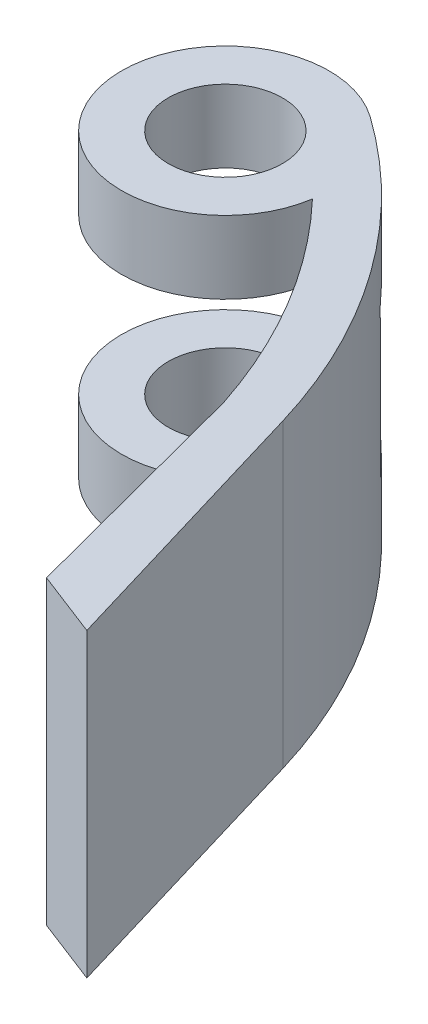
ISO-10303-21;
HEADER;
FILE_DESCRIPTION(('STEP AP214'),'2;1');
FILE_NAME('part.step','',(''),(''),'','','');
FILE_SCHEMA(('AUTOMOTIVE_DESIGN { 1 0 10303 214 1 1 1 1 }'));
ENDSEC;
DATA;
#1=APPLICATION_CONTEXT('core data for automotive mechanical design processes');
#2=APPLICATION_PROTOCOL_DEFINITION('international standard','automotive_design',2000,#1);
#3=PRODUCT_CONTEXT('',#1,'mechanical');
#4=PRODUCT('Part','Part','',(#3));
#5=PRODUCT_RELATED_PRODUCT_CATEGORY('part','',(#4));
#6=PRODUCT_DEFINITION_FORMATION('','',#4);
#7=PRODUCT_DEFINITION_CONTEXT('part definition',#1,'design');
#8=PRODUCT_DEFINITION('design','',#6,#7);
#9=PRODUCT_DEFINITION_SHAPE('','',#8);
#10=(LENGTH_UNIT() NAMED_UNIT(*) SI_UNIT(.MILLI.,.METRE.));
#11=(NAMED_UNIT(*) PLANE_ANGLE_UNIT() SI_UNIT($,.RADIAN.));
#12=(NAMED_UNIT(*) SI_UNIT($,.STERADIAN.) SOLID_ANGLE_UNIT());
#13=UNCERTAINTY_MEASURE_WITH_UNIT(LENGTH_MEASURE(1.E-05),#10,'distance_accuracy_value','');
#14=(GEOMETRIC_REPRESENTATION_CONTEXT(3) GLOBAL_UNCERTAINTY_ASSIGNED_CONTEXT((#13)) GLOBAL_UNIT_ASSIGNED_CONTEXT((#10,
#11,#12)) REPRESENTATION_CONTEXT('',''));
#15=CARTESIAN_POINT('',(0.,0.,0.));
#16=DIRECTION('',(0.,0.,1.));
#17=DIRECTION('',(1.,0.,0.));
#18=AXIS2_PLACEMENT_3D('',#15,#16,#17);
#19=CARTESIAN_POINT('',(-7.61734022617568,29.,-22.6247450499297));
#20=DIRECTION('',(0.,-1.,0.));
#21=DIRECTION('',(0.,0.,-1.));
#22=AXIS2_PLACEMENT_3D('',#19,#20,#21);
#23=CYLINDRICAL_SURFACE('',#22,55.9999999999987);
#24=CARTESIAN_POINT('',(-7.61734022617568,22.,-22.6247450499297));
#25=DIRECTION('',(0.,1.,0.));
#26=DIRECTION('',(0.,0.,1.));
#27=AXIS2_PLACEMENT_3D('',#24,#25,#26);
#28=CIRCLE('',#27,55.9999999999987);
#29=CARTESIAN_POINT('',(34.5830395151226,22.,-59.4368076067884));
#30=VERTEX_POINT('',#29);
#31=CARTESIAN_POINT('',(32.9081332083161,22.,-61.2729791998901));
#32=VERTEX_POINT('',#31);
#33=EDGE_CURVE('E172',#30,#32,#28,.T.);
#34=ORIENTED_EDGE('',*,*,#33,.F.);
#35=DIRECTION('',(0.,-1.,0.));
#36=VECTOR('',#35,1.);
#37=CARTESIAN_POINT('',(34.5830395151226,29.,-59.4368076067884));
#38=LINE('',#37,#36);
#39=CARTESIAN_POINT('',(34.5830395151226,21.,-59.4368076067884));
#40=VERTEX_POINT('',#39);
#41=EDGE_CURVE('E159',#30,#40,#38,.T.);
#42=ORIENTED_EDGE('',*,*,#41,.T.);
#43=DIRECTION('',(0.,-1.,0.));
#44=VECTOR('',#43,1.);
#45=CARTESIAN_POINT('',(34.5830395151226,29.,-59.4368076067884));
#46=LINE('',#45,#44);
#47=CARTESIAN_POINT('',(34.5830395151226,7.,-59.4368076067884));
#48=VERTEX_POINT('',#47);
#49=EDGE_CURVE('E198',#48,#40,#46,.F.);
#50=ORIENTED_EDGE('',*,*,#49,.F.);
#51=CARTESIAN_POINT('',(-7.61734022617568,7.,-22.6247450499297));
#52=DIRECTION('',(0.,-1.,0.));
#53=DIRECTION('',(0.,0.,-1.));
#54=AXIS2_PLACEMENT_3D('',#51,#52,#53);
#55=CIRCLE('',#54,55.9999999999987);
#56=CARTESIAN_POINT('',(32.9081332083161,7.,-61.2729791998901));
#57=VERTEX_POINT('',#56);
#58=EDGE_CURVE('E193',#57,#48,#55,.T.);
#59=ORIENTED_EDGE('',*,*,#58,.F.);
#60=DIRECTION('',(0.,-1.,0.));
#61=VECTOR('',#60,1.);
#62=CARTESIAN_POINT('',(32.9081332083161,29.,-61.2729791998901));
#63=LINE('',#62,#61);
#64=CARTESIAN_POINT('',(32.9081332083161,0.,-61.2729791998901));
#65=VERTEX_POINT('',#64);
#66=EDGE_CURVE('E250',#57,#65,#63,.T.);
#67=ORIENTED_EDGE('',*,*,#66,.T.);
#68=CARTESIAN_POINT('',(-7.61734022617568,0.,-22.6247450499297));
#69=DIRECTION('',(0.,1.,0.));
#70=DIRECTION('',(0.,0.,1.));
#71=AXIS2_PLACEMENT_3D('',#68,#69,#70);
#72=CIRCLE('',#71,55.9999999999987);
#73=CARTESIAN_POINT('',(45.618872447791,0.,-40.0001777102133));
#74=VERTEX_POINT('',#73);
#75=EDGE_CURVE('E226',#74,#65,#72,.T.);
#76=ORIENTED_EDGE('',*,*,#75,.F.);
#77=DIRECTION('',(0.,-1.,0.));
#78=VECTOR('',#77,1.);
#79=CARTESIAN_POINT('',(45.618872447791,29.,-40.0001777102133));
#80=LINE('',#79,#78);
#81=CARTESIAN_POINT('',(45.618872447791,29.,-40.0001777102133));
#82=VERTEX_POINT('',#81);
#83=EDGE_CURVE('E248',#82,#74,#80,.T.);
#84=ORIENTED_EDGE('',*,*,#83,.F.);
#85=CARTESIAN_POINT('',(-7.61734022617568,29.,-22.6247450499297));
#86=DIRECTION('',(0.,1.,0.));
#87=DIRECTION('',(0.,0.,1.));
#88=AXIS2_PLACEMENT_3D('',#85,#86,#87);
#89=CIRCLE('',#88,55.9999999999987);
#90=CARTESIAN_POINT('',(32.9081332083161,29.,-61.2729791998901));
#91=VERTEX_POINT('',#90);
#92=EDGE_CURVE('E208',#82,#91,#89,.T.);
#93=ORIENTED_EDGE('',*,*,#92,.T.);
#94=EDGE_CURVE('E251',#91,#32,#63,.T.);
#95=ORIENTED_EDGE('',*,*,#94,.T.);
#96=EDGE_LOOP('',(#34,#42,#50,#59,#67,#76,#84,#93,#95));
#97=FACE_BOUND('',#96,.T.);
#98=ADVANCED_FACE('F35',(#97),#23,.F.);
#99=CARTESIAN_POINT('',(-3.64937591935032,29.,-25.2895708429214));
#100=DIRECTION('',(0.,-1.,0.));
#101=DIRECTION('',(0.,0.,-1.));
#102=AXIS2_PLACEMENT_3D('',#99,#100,#101);
#103=CYLINDRICAL_SURFACE('',#102,56.);
#104=CARTESIAN_POINT('',(-3.64937591935032,21.,-25.2895708429214));
#105=DIRECTION('',(0.,1.,0.));
#106=DIRECTION('',(0.,0.,1.));
#107=AXIS2_PLACEMENT_3D('',#104,#105,#106);
#108=CIRCLE('',#107,56.);
#109=CARTESIAN_POINT('',(38.1282274530216,21.,-62.5807474998838));
#110=VERTEX_POINT('',#109);
#111=CARTESIAN_POINT('',(38.0522506094171,21.,-62.6656908242036));
#112=VERTEX_POINT('',#111);
#113=EDGE_CURVE('E165',#110,#112,#108,.T.);
#114=ORIENTED_EDGE('',*,*,#113,.F.);
#115=DIRECTION('',(0.,-1.,0.));
#116=VECTOR('',#115,1.);
#117=CARTESIAN_POINT('',(38.1282274530216,29.,-62.5807474998838));
#118=LINE('',#117,#116);
#119=CARTESIAN_POINT('',(38.1282274530216,22.,-62.5807474998838));
#120=VERTEX_POINT('',#119);
#121=EDGE_CURVE('E156',#120,#110,#118,.T.);
#122=ORIENTED_EDGE('',*,*,#121,.F.);
#123=CARTESIAN_POINT('',(-3.64937591935032,22.,-25.2895708429214));
#124=DIRECTION('',(0.,1.,0.));
#125=DIRECTION('',(0.,0.,1.));
#126=AXIS2_PLACEMENT_3D('',#123,#124,#125);
#127=CIRCLE('',#126,56.);
#128=CARTESIAN_POINT('',(28.818508763389,22.,-70.9167169757703));
#129=VERTEX_POINT('',#128);
#130=EDGE_CURVE('E11',#120,#129,#127,.T.);
#131=ORIENTED_EDGE('',*,*,#130,.T.);
#132=DIRECTION('',(0.,-1.,0.));
#133=VECTOR('',#132,1.);
#134=CARTESIAN_POINT('',(28.818508763389,29.,-70.9167169757702));
#135=LINE('',#134,#133);
#136=CARTESIAN_POINT('',(28.818508763389,29.,-70.9167169757702));
#137=VERTEX_POINT('',#136);
#138=EDGE_CURVE('E239',#137,#129,#135,.T.);
#139=ORIENTED_EDGE('',*,*,#138,.F.);
#140=CARTESIAN_POINT('',(-3.64937591935032,29.,-25.2895708429214));
#141=DIRECTION('',(0.,1.,0.));
#142=DIRECTION('',(0.,0.,1.));
#143=AXIS2_PLACEMENT_3D('',#140,#141,#142);
#144=CIRCLE('',#143,56.);
#145=CARTESIAN_POINT('',(50.0097940460506,29.,-41.3112273934852));
#146=VERTEX_POINT('',#145);
#147=EDGE_CURVE('E218',#146,#137,#144,.T.);
#148=ORIENTED_EDGE('',*,*,#147,.F.);
#149=DIRECTION('',(0.,-1.,0.));
#150=VECTOR('',#149,1.);
#151=CARTESIAN_POINT('',(50.0097940460506,29.,-41.3112273934852));
#152=LINE('',#151,#150);
#153=CARTESIAN_POINT('',(50.0097940460506,0.,-41.3112273934852));
#154=VERTEX_POINT('',#153);
#155=EDGE_CURVE('E241',#146,#154,#152,.T.);
#156=ORIENTED_EDGE('',*,*,#155,.T.);
#157=CARTESIAN_POINT('',(-3.64937591935032,0.,-25.2895708429214));
#158=DIRECTION('',(0.,1.,0.));
#159=DIRECTION('',(0.,0.,1.));
#160=AXIS2_PLACEMENT_3D('',#157,#158,#159);
#161=CIRCLE('',#160,56.);
#162=CARTESIAN_POINT('',(28.818508763389,0.,-70.9167169757702));
#163=VERTEX_POINT('',#162);
#164=EDGE_CURVE('E206',#154,#163,#161,.T.);
#165=ORIENTED_EDGE('',*,*,#164,.T.);
#166=CARTESIAN_POINT('',(28.818508763389,7.,-70.9167169757703));
#167=VERTEX_POINT('',#166);
#168=EDGE_CURVE('E220',#167,#163,#135,.T.);
#169=ORIENTED_EDGE('',*,*,#168,.F.);
#170=CARTESIAN_POINT('',(-3.64937591935032,7.,-25.2895708429214));
#171=DIRECTION('',(0.,-1.,0.));
#172=DIRECTION('',(0.,0.,-1.));
#173=AXIS2_PLACEMENT_3D('',#170,#171,#172);
#174=CIRCLE('',#173,56.);
#175=CARTESIAN_POINT('',(38.0522506094171,7.,-62.6656908242036));
#176=VERTEX_POINT('',#175);
#177=EDGE_CURVE('E254',#167,#176,#174,.T.);
#178=ORIENTED_EDGE('',*,*,#177,.T.);
#179=DIRECTION('',(0.,-1.,0.));
#180=VECTOR('',#179,1.);
#181=CARTESIAN_POINT('',(38.0522506094171,29.,-62.6656908242036));
#182=LINE('',#181,#180);
#183=EDGE_CURVE('E257',#176,#112,#182,.F.);
#184=ORIENTED_EDGE('',*,*,#183,.T.);
#185=EDGE_LOOP('',(#114,#122,#131,#139,#148,#156,#165,#169,#178,#184));
#186=FACE_BOUND('',#185,.T.);
#187=ADVANCED_FACE('F163',(#186),#103,.T.);
#188=CARTESIAN_POINT('',(23.0206722128998,29.,-62.7690123091901));
#189=DIRECTION('',(0.,-1.,0.));
#190=DIRECTION('',(0.,0.,-1.));
#191=AXIS2_PLACEMENT_3D('',#188,#189,#190);
#192=CYLINDRICAL_SURFACE('',#191,10.);
#193=ORIENTED_EDGE('',*,*,#138,.T.);
#194=CARTESIAN_POINT('',(23.0206722128998,22.,-62.7690123091901));
#195=DIRECTION('',(0.,1.,0.));
#196=DIRECTION('',(0.,0.,1.));
#197=AXIS2_PLACEMENT_3D('',#194,#195,#196);
#198=CIRCLE('',#197,10.);
#199=EDGE_CURVE('E148',#129,#32,#198,.T.);
#200=ORIENTED_EDGE('',*,*,#199,.T.);
#201=ORIENTED_EDGE('',*,*,#94,.F.);
#202=CARTESIAN_POINT('',(23.0206722128998,29.,-62.7690123091901));
#203=DIRECTION('',(0.,1.,0.));
#204=DIRECTION('',(0.,0.,1.));
#205=AXIS2_PLACEMENT_3D('',#202,#203,#204);
#206=CIRCLE('',#205,10.);
#207=EDGE_CURVE('E205',#137,#91,#206,.T.);
#208=ORIENTED_EDGE('',*,*,#207,.F.);
#209=EDGE_LOOP('',(#193,#200,#201,#208));
#210=FACE_BOUND('',#209,.T.);
#211=ADVANCED_FACE('F323',(#210),#192,.T.);
#212=CARTESIAN_POINT('',(23.0206722128998,29.,-62.7690123091901));
#213=DIRECTION('',(0.,-1.,0.));
#214=DIRECTION('',(0.,0.,-1.));
#215=AXIS2_PLACEMENT_3D('',#212,#213,#214);
#216=CYLINDRICAL_SURFACE('',#215,5.50000000000001);
#217=CARTESIAN_POINT('',(23.0206722128998,22.,-62.7690123091901));
#218=DIRECTION('',(0.,1.,0.));
#219=DIRECTION('',(0.,0.,1.));
#220=AXIS2_PLACEMENT_3D('',#217,#218,#219);
#221=CIRCLE('',#220,5.50000000000001);
#222=CARTESIAN_POINT('',(23.0206722128998,22.,-57.2690123091901));
#223=VERTEX_POINT('',#222);
#224=EDGE_CURVE('E174',#223,#223,#221,.T.);
#225=ORIENTED_EDGE('',*,*,#224,.F.);
#226=EDGE_LOOP('',(#225));
#227=FACE_BOUND('',#226,.T.);
#228=CARTESIAN_POINT('',(23.0206722128998,29.,-62.7690123091901));
#229=DIRECTION('',(0.,1.,0.));
#230=DIRECTION('',(0.,0.,1.));
#231=AXIS2_PLACEMENT_3D('',#228,#229,#230);
#232=CIRCLE('',#231,5.50000000000001);
#233=CARTESIAN_POINT('',(23.0206722128998,29.,-57.2690123091901));
#234=VERTEX_POINT('',#233);
#235=EDGE_CURVE('E202',#234,#234,#232,.T.);
#236=ORIENTED_EDGE('',*,*,#235,.T.);
#237=EDGE_LOOP('',(#236));
#238=FACE_BOUND('',#237,.T.);
#239=ADVANCED_FACE('F325',(#227,#238),#216,.F.);
#240=ORIENTED_EDGE('',*,*,#66,.F.);
#241=CARTESIAN_POINT('',(23.0206722128998,7.,-62.7690123091901));
#242=DIRECTION('',(0.,-1.,0.));
#243=DIRECTION('',(0.,0.,-1.));
#244=AXIS2_PLACEMENT_3D('',#241,#242,#243);
#245=CIRCLE('',#244,10.);
#246=EDGE_CURVE('E188',#57,#167,#245,.T.);
#247=ORIENTED_EDGE('',*,*,#246,.T.);
#248=ORIENTED_EDGE('',*,*,#168,.T.);
#249=CARTESIAN_POINT('',(23.0206722128998,0.,-62.7690123091901));
#250=DIRECTION('',(0.,1.,0.));
#251=DIRECTION('',(0.,0.,1.));
#252=AXIS2_PLACEMENT_3D('',#249,#250,#251);
#253=CIRCLE('',#252,10.);
#254=EDGE_CURVE('E223',#163,#65,#253,.T.);
#255=ORIENTED_EDGE('',*,*,#254,.T.);
#256=EDGE_LOOP('',(#240,#247,#248,#255));
#257=FACE_BOUND('',#256,.T.);
#258=ADVANCED_FACE('F293',(#257),#192,.T.);
#259=CARTESIAN_POINT('',(52.5085936316344,29.,-13.816725342061));
#260=DIRECTION('',(0.967080545762288,0.,-0.254470465885758));
#261=DIRECTION('',(-0.254470465885758,0.,-0.967080545762288));
#262=AXIS2_PLACEMENT_3D('',#259,#260,#261);
#263=PLANE('',#262);
#264=DIRECTION('',(-0.254470465885758,0.,-0.967080545762288));
#265=VECTOR('',#264,1.);
#266=CARTESIAN_POINT('',(52.5085936316344,15.5,-13.816725342061));
#267=LINE('',#266,#265);
#268=CARTESIAN_POINT('',(49.829088917422,15.5,-23.9998201557295));
#269=VERTEX_POINT('',#268);
#270=CARTESIAN_POINT('',(49.3201479856505,15.5,-25.9339812472541));
#271=VERTEX_POINT('',#270);
#272=EDGE_CURVE('E268',#269,#271,#267,.T.);
#273=ORIENTED_EDGE('',*,*,#272,.F.);
#274=DIRECTION('',(0.,-1.,0.));
#275=VECTOR('',#274,1.);
#276=CARTESIAN_POINT('',(49.829088917422,15.5,-23.9998201557295));
#277=LINE('',#276,#275);
#278=CARTESIAN_POINT('',(49.829088917422,13.5,-23.9998201557295));
#279=VERTEX_POINT('',#278);
#280=EDGE_CURVE('E43',#269,#279,#277,.T.);
#281=ORIENTED_EDGE('',*,*,#280,.T.);
#282=DIRECTION('',(-0.254470465885758,0.,-0.967080545762288));
#283=VECTOR('',#282,1.);
#284=CARTESIAN_POINT('',(52.5085936316344,13.5,-13.816725342061));
#285=LINE('',#284,#283);
#286=CARTESIAN_POINT('',(49.3201479856505,13.5,-25.9339812472541));
#287=VERTEX_POINT('',#286);
#288=EDGE_CURVE('E263',#279,#287,#285,.T.);
#289=ORIENTED_EDGE('',*,*,#288,.T.);
#290=DIRECTION('',(0.,-1.,0.));
#291=VECTOR('',#290,1.);
#292=CARTESIAN_POINT('',(49.3201479856505,15.5,-25.9339812472541));
#293=LINE('',#292,#291);
#294=EDGE_CURVE('E271',#271,#287,#293,.T.);
#295=ORIENTED_EDGE('',*,*,#294,.F.);
#296=EDGE_LOOP('',(#273,#281,#289,#295));
#297=FACE_BOUND('',#296,.T.);
#298=CARTESIAN_POINT('',(48.3022661221075,13.5,-29.8023034303033));
#299=VERTEX_POINT('',#298);
#300=CARTESIAN_POINT('',(47.793325190336,13.5,-31.7364645218278));
#301=VERTEX_POINT('',#300);
#302=EDGE_CURVE('E259',#299,#301,#285,.T.);
#303=ORIENTED_EDGE('',*,*,#302,.T.);
#304=DIRECTION('',(0.,-1.,0.));
#305=VECTOR('',#304,1.);
#306=CARTESIAN_POINT('',(47.793325190336,15.5,-31.7364645218278));
#307=LINE('',#306,#305);
#308=CARTESIAN_POINT('',(47.793325190336,15.5,-31.7364645218278));
#309=VERTEX_POINT('',#308);
#310=EDGE_CURVE('E267',#301,#309,#307,.F.);
#311=ORIENTED_EDGE('',*,*,#310,.T.);
#312=CARTESIAN_POINT('',(48.3022661221075,15.5,-29.8023034303033));
#313=VERTEX_POINT('',#312);
#314=EDGE_CURVE('E265',#313,#309,#267,.T.);
#315=ORIENTED_EDGE('',*,*,#314,.F.);
#316=DIRECTION('',(0.,-1.,0.));
#317=VECTOR('',#316,1.);
#318=CARTESIAN_POINT('',(48.3022661221075,15.5,-29.8023034303033));
#319=LINE('',#318,#317);
#320=EDGE_CURVE('E262',#299,#313,#319,.F.);
#321=ORIENTED_EDGE('',*,*,#320,.F.);
#322=EDGE_LOOP('',(#303,#311,#315,#321));
#323=FACE_BOUND('',#322,.T.);
#324=DIRECTION('',(0.254470465885758,0.,0.967080545762288));
#325=VECTOR('',#324,1.);
#326=CARTESIAN_POINT('',(52.5085936316344,0.,-13.816725342061));
#327=LINE('',#326,#325);
#328=CARTESIAN_POINT('',(51.7108084269692,0.,-16.8485999780552));
#329=VERTEX_POINT('',#328);
#330=EDGE_CURVE('E229',#74,#329,#327,.T.);
#331=ORIENTED_EDGE('',*,*,#330,.T.);
#332=DIRECTION('',(0.,-1.,0.));
#333=VECTOR('',#332,1.);
#334=CARTESIAN_POINT('',(51.7108084269692,29.,-16.8485999780552));
#335=LINE('',#334,#333);
#336=CARTESIAN_POINT('',(51.7108084269692,29.,-16.8485999780552));
#337=VERTEX_POINT('',#336);
#338=EDGE_CURVE('E245',#337,#329,#335,.T.);
#339=ORIENTED_EDGE('',*,*,#338,.F.);
#340=DIRECTION('',(0.254470465885758,0.,0.967080545762288));
#341=VECTOR('',#340,1.);
#342=CARTESIAN_POINT('',(52.5085936316344,29.,-13.816725342061));
#343=LINE('',#342,#341);
#344=EDGE_CURVE('E211',#82,#337,#343,.T.);
#345=ORIENTED_EDGE('',*,*,#344,.F.);
#346=ORIENTED_EDGE('',*,*,#83,.T.);
#347=EDGE_LOOP('',(#331,#339,#345,#346));
#348=FACE_BOUND('',#347,.T.);
#349=ADVANCED_FACE('F285',(#297,#323,#348),#263,.F.);
#350=CARTESIAN_POINT('',(12.3958995405945,29.,-32.0529370912444));
#351=DIRECTION('',(0.360698279817035,0.,-0.932682556359361));
#352=DIRECTION('',(-0.932682556359361,0.,-0.360698279817035));
#353=AXIS2_PLACEMENT_3D('',#350,#351,#352);
#354=PLANE('',#353);
#355=DIRECTION('',(0.932682556359361,0.,0.360698279817035));
#356=VECTOR('',#355,1.);
#357=CARTESIAN_POINT('',(12.3958995405945,0.,-32.0529370912444));
#358=LINE('',#357,#356);
#359=CARTESIAN_POINT('',(58.0453486153183,0.,-14.3988299745418));
#360=VERTEX_POINT('',#359);
#361=EDGE_CURVE('E231',#329,#360,#358,.T.);
#362=ORIENTED_EDGE('',*,*,#361,.T.);
#363=DIRECTION('',(0.,-1.,0.));
#364=VECTOR('',#363,1.);
#365=CARTESIAN_POINT('',(58.0453486153183,29.,-14.3988299745418));
#366=LINE('',#365,#364);
#367=CARTESIAN_POINT('',(58.0453486153183,29.,-14.3988299745418));
#368=VERTEX_POINT('',#367);
#369=EDGE_CURVE('E243',#368,#360,#366,.T.);
#370=ORIENTED_EDGE('',*,*,#369,.F.);
#371=DIRECTION('',(0.932682556359361,0.,0.360698279817035));
#372=VECTOR('',#371,1.);
#373=CARTESIAN_POINT('',(12.3958995405945,29.,-32.0529370912444));
#374=LINE('',#373,#372);
#375=EDGE_CURVE('E213',#337,#368,#374,.T.);
#376=ORIENTED_EDGE('',*,*,#375,.F.);
#377=ORIENTED_EDGE('',*,*,#338,.T.);
#378=EDGE_LOOP('',(#362,#370,#376,#377));
#379=FACE_BOUND('',#378,.T.);
#380=ADVANCED_FACE('F292',(#379),#354,.F.);
#381=CARTESIAN_POINT('',(57.2414386246392,29.,-17.0912571084399));
#382=DIRECTION('',(0.958199463667872,0.,-0.286101009831496));
#383=DIRECTION('',(-0.286101009831496,0.,-0.958199463667872));
#384=AXIS2_PLACEMENT_3D('',#381,#382,#383);
#385=PLANE('',#384);
#386=DIRECTION('',(0.286101009831496,0.,0.958199463667872));
#387=VECTOR('',#386,1.);
#388=CARTESIAN_POINT('',(57.2414386246392,0.,-17.0912571084399));
#389=LINE('',#388,#387);
#390=EDGE_CURVE('E234',#154,#360,#389,.T.);
#391=ORIENTED_EDGE('',*,*,#390,.F.);
#392=ORIENTED_EDGE('',*,*,#155,.F.);
#393=DIRECTION('',(0.286101009831496,0.,0.958199463667872));
#394=VECTOR('',#393,1.);
#395=CARTESIAN_POINT('',(57.2414386246392,29.,-17.0912571084399));
#396=LINE('',#395,#394);
#397=EDGE_CURVE('E215',#146,#368,#396,.T.);
#398=ORIENTED_EDGE('',*,*,#397,.T.);
#399=ORIENTED_EDGE('',*,*,#369,.T.);
#400=EDGE_LOOP('',(#391,#392,#398,#399));
#401=FACE_BOUND('',#400,.T.);
#402=ADVANCED_FACE('F309',(#401),#385,.T.);
#403=CARTESIAN_POINT('',(23.0206722128998,7.,-62.7690123091901));
#404=DIRECTION('',(0.,-1.,0.));
#405=DIRECTION('',(0.,0.,-1.));
#406=AXIS2_PLACEMENT_3D('',#403,#404,#405);
#407=CIRCLE('',#406,5.50000000000001);
#408=CARTESIAN_POINT('',(23.0206722128998,7.,-68.2690123091901));
#409=VERTEX_POINT('',#408);
#410=EDGE_CURVE('E195',#409,#409,#407,.T.);
#411=ORIENTED_EDGE('',*,*,#410,.F.);
#412=EDGE_LOOP('',(#411));
#413=FACE_BOUND('',#412,.T.);
#414=CARTESIAN_POINT('',(23.0206722128998,0.,-62.7690123091901));
#415=DIRECTION('',(0.,1.,0.));
#416=DIRECTION('',(0.,0.,1.));
#417=AXIS2_PLACEMENT_3D('',#414,#415,#416);
#418=CIRCLE('',#417,5.50000000000001);
#419=CARTESIAN_POINT('',(23.0206722128998,0.,-57.2690123091901));
#420=VERTEX_POINT('',#419);
#421=EDGE_CURVE('E201',#420,#420,#418,.T.);
#422=ORIENTED_EDGE('',*,*,#421,.F.);
#423=EDGE_LOOP('',(#422));
#424=FACE_BOUND('',#423,.T.);
#425=ADVANCED_FACE('F37',(#413,#424),#216,.F.);
#426=CARTESIAN_POINT('',(0.,29.,0.));
#427=DIRECTION('',(0.,1.,0.));
#428=DIRECTION('',(0.,0.,1.));
#429=AXIS2_PLACEMENT_3D('',#426,#427,#428);
#430=PLANE('',#429);
#431=ORIENTED_EDGE('',*,*,#235,.F.);
#432=EDGE_LOOP('',(#431));
#433=FACE_BOUND('',#432,.T.);
#434=ORIENTED_EDGE('',*,*,#207,.T.);
#435=ORIENTED_EDGE('',*,*,#92,.F.);
#436=ORIENTED_EDGE('',*,*,#344,.T.);
#437=ORIENTED_EDGE('',*,*,#375,.T.);
#438=ORIENTED_EDGE('',*,*,#397,.F.);
#439=ORIENTED_EDGE('',*,*,#147,.T.);
#440=EDGE_LOOP('',(#434,#435,#436,#437,#438,#439));
#441=FACE_BOUND('',#440,.T.);
#442=ADVANCED_FACE('F313',(#433,#441),#430,.T.);
#443=CARTESIAN_POINT('',(0.,0.,0.));
#444=DIRECTION('',(0.,1.,0.));
#445=DIRECTION('',(0.,0.,1.));
#446=AXIS2_PLACEMENT_3D('',#443,#444,#445);
#447=PLANE('',#446);
#448=ORIENTED_EDGE('',*,*,#421,.T.);
#449=EDGE_LOOP('',(#448));
#450=FACE_BOUND('',#449,.T.);
#451=ORIENTED_EDGE('',*,*,#254,.F.);
#452=ORIENTED_EDGE('',*,*,#164,.F.);
#453=ORIENTED_EDGE('',*,*,#390,.T.);
#454=ORIENTED_EDGE('',*,*,#361,.F.);
#455=ORIENTED_EDGE('',*,*,#330,.F.);
#456=ORIENTED_EDGE('',*,*,#75,.T.);
#457=EDGE_LOOP('',(#451,#452,#453,#454,#455,#456));
#458=FACE_BOUND('',#457,.T.);
#459=ADVANCED_FACE('F305',(#450,#458),#447,.F.);
#460=CARTESIAN_POINT('',(-13.5897102283462,21.,-14.6012011949348));
#461=DIRECTION('',(0.681297360909416,0.,0.732006766374372));
#462=DIRECTION('',(0.732006766374372,0.,-0.681297360909416));
#463=AXIS2_PLACEMENT_3D('',#460,#461,#462);
#464=PLANE('',#463);
#465=ORIENTED_EDGE('',*,*,#49,.T.);
#466=DIRECTION('',(-0.732006766374372,0.,0.681297360909416));
#467=VECTOR('',#466,1.);
#468=CARTESIAN_POINT('',(-13.5897102283462,21.,-14.6012011949348));
#469=LINE('',#468,#467);
#470=EDGE_CURVE('E186',#112,#40,#469,.T.);
#471=ORIENTED_EDGE('',*,*,#470,.F.);
#472=ORIENTED_EDGE('',*,*,#183,.F.);
#473=DIRECTION('',(-0.732006766374372,0.,0.681297360909416));
#474=VECTOR('',#473,1.);
#475=CARTESIAN_POINT('',(-13.5897102283462,7.,-14.6012011949348));
#476=LINE('',#475,#474);
#477=EDGE_CURVE('E185',#176,#48,#476,.T.);
#478=ORIENTED_EDGE('',*,*,#477,.T.);
#479=EDGE_LOOP('',(#465,#471,#472,#478));
#480=FACE_BOUND('',#479,.T.);
#481=ADVANCED_FACE('F344',(#480),#464,.F.);
#482=CARTESIAN_POINT('',(0.,7.,0.));
#483=DIRECTION('',(0.,-1.,0.));
#484=DIRECTION('',(0.,0.,-1.));
#485=AXIS2_PLACEMENT_3D('',#482,#483,#484);
#486=PLANE('',#485);
#487=ORIENTED_EDGE('',*,*,#410,.T.);
#488=EDGE_LOOP('',(#487));
#489=FACE_BOUND('',#488,.T.);
#490=ORIENTED_EDGE('',*,*,#58,.T.);
#491=ORIENTED_EDGE('',*,*,#477,.F.);
#492=ORIENTED_EDGE('',*,*,#177,.F.);
#493=ORIENTED_EDGE('',*,*,#246,.F.);
#494=EDGE_LOOP('',(#490,#491,#492,#493));
#495=FACE_BOUND('',#494,.T.);
#496=ADVANCED_FACE('F351',(#489,#495),#486,.F.);
#497=CARTESIAN_POINT('',(48.811207053879,15.5,-27.8681423387787));
#498=DIRECTION('',(0.,-1.,0.));
#499=DIRECTION('',(0.,0.,-1.));
#500=AXIS2_PLACEMENT_3D('',#497,#498,#499);
#501=CYLINDRICAL_SURFACE('',#500,4.);
#502=ORIENTED_EDGE('',*,*,#280,.F.);
#503=CARTESIAN_POINT('',(48.811207053879,15.5,-27.8681423387787));
#504=DIRECTION('',(0.,-1.,0.));
#505=DIRECTION('',(0.,0.,-1.));
#506=AXIS2_PLACEMENT_3D('',#503,#504,#505);
#507=CIRCLE('',#506,4.);
#508=EDGE_CURVE('E182',#269,#309,#507,.T.);
#509=ORIENTED_EDGE('',*,*,#508,.T.);
#510=ORIENTED_EDGE('',*,*,#310,.F.);
#511=CARTESIAN_POINT('',(48.811207053879,13.5,-27.8681423387787));
#512=DIRECTION('',(0.,-1.,0.));
#513=DIRECTION('',(0.,0.,-1.));
#514=AXIS2_PLACEMENT_3D('',#511,#512,#513);
#515=CIRCLE('',#514,4.);
#516=EDGE_CURVE('E55',#279,#301,#515,.T.);
#517=ORIENTED_EDGE('',*,*,#516,.F.);
#518=EDGE_LOOP('',(#502,#509,#510,#517));
#519=FACE_BOUND('',#518,.T.);
#520=ADVANCED_FACE('F289',(#519),#501,.T.);
#521=CARTESIAN_POINT('',(48.811207053879,15.5,-27.8681423387787));
#522=DIRECTION('',(0.,-1.,0.));
#523=DIRECTION('',(0.,0.,-1.));
#524=AXIS2_PLACEMENT_3D('',#521,#522,#523);
#525=PLANE('',#524);
#526=ORIENTED_EDGE('',*,*,#508,.F.);
#527=ORIENTED_EDGE('',*,*,#272,.T.);
#528=CARTESIAN_POINT('',(48.811207053879,15.5,-27.8681423387787));
#529=DIRECTION('',(0.,-1.,0.));
#530=DIRECTION('',(0.,0.,-1.));
#531=AXIS2_PLACEMENT_3D('',#528,#529,#530);
#532=CIRCLE('',#531,2.);
#533=EDGE_CURVE('E179',#271,#313,#532,.T.);
#534=ORIENTED_EDGE('',*,*,#533,.T.);
#535=ORIENTED_EDGE('',*,*,#314,.T.);
#536=EDGE_LOOP('',(#526,#527,#534,#535));
#537=FACE_BOUND('',#536,.T.);
#538=ADVANCED_FACE('F279',(#537),#525,.F.);
#539=CARTESIAN_POINT('',(48.811207053879,15.5,-27.8681423387787));
#540=DIRECTION('',(0.,-1.,0.));
#541=DIRECTION('',(0.,0.,-1.));
#542=AXIS2_PLACEMENT_3D('',#539,#540,#541);
#543=CYLINDRICAL_SURFACE('',#542,2.);
#544=ORIENTED_EDGE('',*,*,#533,.F.);
#545=ORIENTED_EDGE('',*,*,#294,.T.);
#546=CARTESIAN_POINT('',(48.811207053879,13.5,-27.8681423387787));
#547=DIRECTION('',(0.,-1.,0.));
#548=DIRECTION('',(0.,0.,-1.));
#549=AXIS2_PLACEMENT_3D('',#546,#547,#548);
#550=CIRCLE('',#549,2.);
#551=EDGE_CURVE('E50',#287,#299,#550,.T.);
#552=ORIENTED_EDGE('',*,*,#551,.T.);
#553=ORIENTED_EDGE('',*,*,#320,.T.);
#554=EDGE_LOOP('',(#544,#545,#552,#553));
#555=FACE_BOUND('',#554,.T.);
#556=ADVANCED_FACE('F283',(#555),#543,.F.);
#557=CARTESIAN_POINT('',(48.811207053879,13.5,-27.8681423387787));
#558=DIRECTION('',(0.,-1.,0.));
#559=DIRECTION('',(0.,0.,-1.));
#560=AXIS2_PLACEMENT_3D('',#557,#558,#559);
#561=PLANE('',#560);
#562=ORIENTED_EDGE('',*,*,#288,.F.);
#563=ORIENTED_EDGE('',*,*,#516,.T.);
#564=ORIENTED_EDGE('',*,*,#302,.F.);
#565=ORIENTED_EDGE('',*,*,#551,.F.);
#566=EDGE_LOOP('',(#562,#563,#564,#565));
#567=FACE_BOUND('',#566,.T.);
#568=ADVANCED_FACE('F287',(#567),#561,.T.);
#569=CARTESIAN_POINT('',(0.,21.,0.));
#570=DIRECTION('',(0.,1.,0.));
#571=DIRECTION('',(0.,0.,1.));
#572=AXIS2_PLACEMENT_3D('',#569,#570,#571);
#573=PLANE('',#572);
#574=ORIENTED_EDGE('',*,*,#113,.T.);
#575=ORIENTED_EDGE('',*,*,#470,.T.);
#576=DIRECTION('',(-0.748177813813198,0.,0.663498273485096));
#577=VECTOR('',#576,1.);
#578=CARTESIAN_POINT('',(-14.2808142224977,21.,-16.1034154743747));
#579=LINE('',#578,#577);
#580=EDGE_CURVE('E160',#110,#40,#579,.T.);
#581=ORIENTED_EDGE('',*,*,#580,.F.);
#582=EDGE_LOOP('',(#574,#575,#581));
#583=FACE_BOUND('',#582,.T.);
#584=ADVANCED_FACE('F364',(#583),#573,.T.);
#585=CARTESIAN_POINT('',(-14.2808142224977,21.,-16.1034154743747));
#586=DIRECTION('',(-0.663498273485096,0.,-0.748177813813198));
#587=DIRECTION('',(-0.748177813813198,0.,0.663498273485096));
#588=AXIS2_PLACEMENT_3D('',#585,#586,#587);
#589=PLANE('',#588);
#590=DIRECTION('',(-0.748177813813198,0.,0.663498273485096));
#591=VECTOR('',#590,1.);
#592=CARTESIAN_POINT('',(-14.2808142224977,22.,-16.1034154743747));
#593=LINE('',#592,#591);
#594=EDGE_CURVE('E145',#120,#30,#593,.T.);
#595=ORIENTED_EDGE('',*,*,#594,.F.);
#596=ORIENTED_EDGE('',*,*,#121,.T.);
#597=ORIENTED_EDGE('',*,*,#580,.T.);
#598=ORIENTED_EDGE('',*,*,#41,.F.);
#599=EDGE_LOOP('',(#595,#596,#597,#598));
#600=FACE_BOUND('',#599,.T.);
#601=ADVANCED_FACE('F154',(#600),#589,.T.);
#602=CARTESIAN_POINT('',(0.,22.,0.));
#603=DIRECTION('',(0.,1.,0.));
#604=DIRECTION('',(0.,0.,1.));
#605=AXIS2_PLACEMENT_3D('',#602,#603,#604);
#606=PLANE('',#605);
#607=ORIENTED_EDGE('',*,*,#224,.T.);
#608=EDGE_LOOP('',(#607));
#609=FACE_BOUND('',#608,.T.);
#610=ORIENTED_EDGE('',*,*,#33,.T.);
#611=ORIENTED_EDGE('',*,*,#199,.F.);
#612=ORIENTED_EDGE('',*,*,#130,.F.);
#613=ORIENTED_EDGE('',*,*,#594,.T.);
#614=EDGE_LOOP('',(#610,#611,#612,#613));
#615=FACE_BOUND('',#614,.T.);
#616=ADVANCED_FACE('F144',(#609,#615),#606,.F.);
#617=CLOSED_SHELL('',(#98,#187,#211,#239,#258,#349,#380,#402,#425,#442,#459,#481,#496,#520,#538,
#556,#568,#584,#601,#616));
#618=MANIFOLD_SOLID_BREP('B2',#617);
#619=ADVANCED_BREP_SHAPE_REPRESENTATION('',(#18,#618),#14);
#620=SHAPE_DEFINITION_REPRESENTATION(#9,#619);
ENDSEC;
END-ISO-10303-21;
